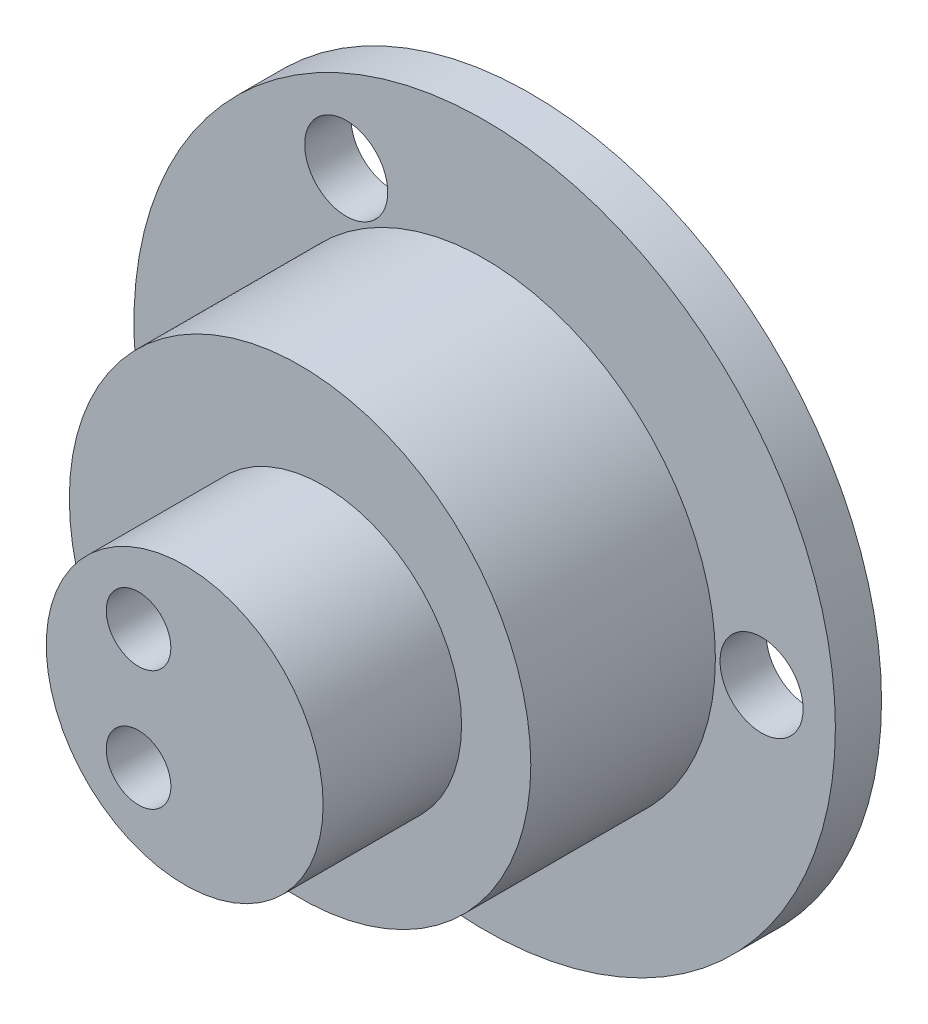
ISO-10303-21;
HEADER;
FILE_DESCRIPTION(('STEP AP214'),'2;1');
FILE_NAME('part.step','',(''),(''),'','','');
FILE_SCHEMA(('AUTOMOTIVE_DESIGN { 1 0 10303 214 1 1 1 1 }'));
ENDSEC;
DATA;
#1=APPLICATION_CONTEXT('core data for automotive mechanical design processes');
#2=APPLICATION_PROTOCOL_DEFINITION('international standard','automotive_design',2000,#1);
#3=PRODUCT_CONTEXT('',#1,'mechanical');
#4=PRODUCT('Part','Part','',(#3));
#5=PRODUCT_RELATED_PRODUCT_CATEGORY('part','',(#4));
#6=PRODUCT_DEFINITION_FORMATION('','',#4);
#7=PRODUCT_DEFINITION_CONTEXT('part definition',#1,'design');
#8=PRODUCT_DEFINITION('design','',#6,#7);
#9=PRODUCT_DEFINITION_SHAPE('','',#8);
#10=(LENGTH_UNIT() NAMED_UNIT(*) SI_UNIT(.MILLI.,.METRE.));
#11=(NAMED_UNIT(*) PLANE_ANGLE_UNIT() SI_UNIT($,.RADIAN.));
#12=(NAMED_UNIT(*) SI_UNIT($,.STERADIAN.) SOLID_ANGLE_UNIT());
#13=UNCERTAINTY_MEASURE_WITH_UNIT(LENGTH_MEASURE(1.E-05),#10,'distance_accuracy_value','');
#14=(GEOMETRIC_REPRESENTATION_CONTEXT(3) GLOBAL_UNCERTAINTY_ASSIGNED_CONTEXT((#13)) GLOBAL_UNIT_ASSIGNED_CONTEXT((#10,
#11,#12)) REPRESENTATION_CONTEXT('',''));
#15=CARTESIAN_POINT('',(0.,0.,0.));
#16=DIRECTION('',(0.,0.,1.));
#17=DIRECTION('',(1.,0.,0.));
#18=AXIS2_PLACEMENT_3D('',#15,#16,#17);
#19=CARTESIAN_POINT('',(0.,0.,1.));
#20=DIRECTION('',(0.,0.,1.));
#21=DIRECTION('',(1.,0.,0.));
#22=AXIS2_PLACEMENT_3D('',#19,#20,#21);
#23=PLANE('',#22);
#24=CARTESIAN_POINT('',(-3.00000000000002,-5.19615242270662,1.));
#25=DIRECTION('',(0.,0.,1.));
#26=DIRECTION('',(1.,0.,0.));
#27=AXIS2_PLACEMENT_3D('',#24,#25,#26);
#28=CIRCLE('',#27,0.9);
#29=CARTESIAN_POINT('',(-2.10000000000002,-5.19615242270662,1.));
#30=VERTEX_POINT('',#29);
#31=EDGE_CURVE('E82',#30,#30,#28,.T.);
#32=ORIENTED_EDGE('',*,*,#31,.F.);
#33=EDGE_LOOP('',(#32));
#34=FACE_BOUND('',#33,.T.);
#35=CARTESIAN_POINT('',(6.,0.,1.));
#36=DIRECTION('',(0.,0.,1.));
#37=DIRECTION('',(1.,0.,0.));
#38=AXIS2_PLACEMENT_3D('',#35,#36,#37);
#39=CIRCLE('',#38,0.899999999999999);
#40=CARTESIAN_POINT('',(6.9,0.,1.));
#41=VERTEX_POINT('',#40);
#42=EDGE_CURVE('E45',#41,#41,#39,.T.);
#43=ORIENTED_EDGE('',*,*,#42,.F.);
#44=EDGE_LOOP('',(#43));
#45=FACE_BOUND('',#44,.T.);
#46=CARTESIAN_POINT('',(-2.99999999999995,5.19615242270666,1.));
#47=DIRECTION('',(0.,0.,1.));
#48=DIRECTION('',(1.,0.,0.));
#49=AXIS2_PLACEMENT_3D('',#46,#47,#48);
#50=CIRCLE('',#49,0.9);
#51=CARTESIAN_POINT('',(-2.09999999999995,5.19615242270666,1.));
#52=VERTEX_POINT('',#51);
#53=EDGE_CURVE('E74',#52,#52,#50,.T.);
#54=ORIENTED_EDGE('',*,*,#53,.F.);
#55=EDGE_LOOP('',(#54));
#56=FACE_BOUND('',#55,.T.);
#57=CARTESIAN_POINT('',(0.,0.,1.));
#58=DIRECTION('',(0.,0.,1.));
#59=DIRECTION('',(1.,0.,0.));
#60=AXIS2_PLACEMENT_3D('',#57,#58,#59);
#61=CIRCLE('',#60,5.);
#62=CARTESIAN_POINT('',(5.,0.,1.));
#63=VERTEX_POINT('',#62);
#64=EDGE_CURVE('E61',#63,#63,#61,.T.);
#65=ORIENTED_EDGE('',*,*,#64,.F.);
#66=EDGE_LOOP('',(#65));
#67=FACE_BOUND('',#66,.T.);
#68=CARTESIAN_POINT('',(0.,0.,1.));
#69=DIRECTION('',(0.,0.,1.));
#70=DIRECTION('',(1.,0.,0.));
#71=AXIS2_PLACEMENT_3D('',#68,#69,#70);
#72=CIRCLE('',#71,7.6);
#73=CARTESIAN_POINT('',(7.6,0.,1.));
#74=VERTEX_POINT('',#73);
#75=EDGE_CURVE('E122',#74,#74,#72,.T.);
#76=ORIENTED_EDGE('',*,*,#75,.T.);
#77=EDGE_LOOP('',(#76));
#78=FACE_BOUND('',#77,.T.);
#79=ADVANCED_FACE('F36',(#34,#45,#56,#67,#78),#23,.T.);
#80=CARTESIAN_POINT('',(0.,0.,0.));
#81=DIRECTION('',(0.,0.,1.));
#82=DIRECTION('',(1.,0.,0.));
#83=AXIS2_PLACEMENT_3D('',#80,#81,#82);
#84=PLANE('',#83);
#85=CARTESIAN_POINT('',(0.,0.,0.));
#86=DIRECTION('',(0.,0.,1.));
#87=DIRECTION('',(1.,0.,0.));
#88=AXIS2_PLACEMENT_3D('',#85,#86,#87);
#89=CIRCLE('',#88,4.45);
#90=CARTESIAN_POINT('',(4.45,0.,0.));
#91=VERTEX_POINT('',#90);
#92=EDGE_CURVE('E66',#91,#91,#89,.T.);
#93=ORIENTED_EDGE('',*,*,#92,.T.);
#94=EDGE_LOOP('',(#93));
#95=FACE_BOUND('',#94,.T.);
#96=CARTESIAN_POINT('',(-2.99999999999995,5.19615242270666,0.));
#97=DIRECTION('',(0.,0.,1.));
#98=DIRECTION('',(1.,0.,0.));
#99=AXIS2_PLACEMENT_3D('',#96,#97,#98);
#100=CIRCLE('',#99,0.9);
#101=CARTESIAN_POINT('',(-2.09999999999995,5.19615242270666,0.));
#102=VERTEX_POINT('',#101);
#103=EDGE_CURVE('E73',#102,#102,#100,.T.);
#104=ORIENTED_EDGE('',*,*,#103,.T.);
#105=EDGE_LOOP('',(#104));
#106=FACE_BOUND('',#105,.T.);
#107=CARTESIAN_POINT('',(-3.00000000000002,-5.19615242270662,0.));
#108=DIRECTION('',(0.,0.,1.));
#109=DIRECTION('',(1.,0.,0.));
#110=AXIS2_PLACEMENT_3D('',#107,#108,#109);
#111=CIRCLE('',#110,0.9);
#112=CARTESIAN_POINT('',(-2.10000000000002,-5.19615242270662,0.));
#113=VERTEX_POINT('',#112);
#114=EDGE_CURVE('E78',#113,#113,#111,.T.);
#115=ORIENTED_EDGE('',*,*,#114,.T.);
#116=EDGE_LOOP('',(#115));
#117=FACE_BOUND('',#116,.T.);
#118=CARTESIAN_POINT('',(6.,0.,0.));
#119=DIRECTION('',(0.,0.,1.));
#120=DIRECTION('',(1.,0.,0.));
#121=AXIS2_PLACEMENT_3D('',#118,#119,#120);
#122=CIRCLE('',#121,0.899999999999999);
#123=CARTESIAN_POINT('',(6.9,0.,0.));
#124=VERTEX_POINT('',#123);
#125=EDGE_CURVE('E51',#124,#124,#122,.T.);
#126=ORIENTED_EDGE('',*,*,#125,.T.);
#127=EDGE_LOOP('',(#126));
#128=FACE_BOUND('',#127,.T.);
#129=CARTESIAN_POINT('',(0.,0.,0.));
#130=DIRECTION('',(0.,0.,1.));
#131=DIRECTION('',(1.,0.,0.));
#132=AXIS2_PLACEMENT_3D('',#129,#130,#131);
#133=CIRCLE('',#132,7.6);
#134=CARTESIAN_POINT('',(7.6,0.,0.));
#135=VERTEX_POINT('',#134);
#136=EDGE_CURVE('E40',#135,#135,#133,.T.);
#137=ORIENTED_EDGE('',*,*,#136,.F.);
#138=EDGE_LOOP('',(#137));
#139=FACE_BOUND('',#138,.T.);
#140=ADVANCED_FACE('F38',(#95,#106,#117,#128,#139),#84,.F.);
#141=CARTESIAN_POINT('',(6.,0.,1.));
#142=DIRECTION('',(0.,0.,-1.));
#143=DIRECTION('',(-1.,0.,0.));
#144=AXIS2_PLACEMENT_3D('',#141,#142,#143);
#145=CYLINDRICAL_SURFACE('',#144,0.899999999999999);
#146=ORIENTED_EDGE('',*,*,#42,.T.);
#147=EDGE_LOOP('',(#146));
#148=FACE_BOUND('',#147,.T.);
#149=ORIENTED_EDGE('',*,*,#125,.F.);
#150=EDGE_LOOP('',(#149));
#151=FACE_BOUND('',#150,.T.);
#152=ADVANCED_FACE('F94',(#148,#151),#145,.F.);
#153=CARTESIAN_POINT('',(-3.00000000000002,-5.19615242270662,1.));
#154=DIRECTION('',(0.,0.,-1.));
#155=DIRECTION('',(-1.,0.,0.));
#156=AXIS2_PLACEMENT_3D('',#153,#154,#155);
#157=CYLINDRICAL_SURFACE('',#156,0.9);
#158=ORIENTED_EDGE('',*,*,#31,.T.);
#159=EDGE_LOOP('',(#158));
#160=FACE_BOUND('',#159,.T.);
#161=ORIENTED_EDGE('',*,*,#114,.F.);
#162=EDGE_LOOP('',(#161));
#163=FACE_BOUND('',#162,.T.);
#164=ADVANCED_FACE('F96',(#160,#163),#157,.F.);
#165=CARTESIAN_POINT('',(-2.99999999999995,5.19615242270666,1.));
#166=DIRECTION('',(0.,0.,-1.));
#167=DIRECTION('',(-1.,0.,0.));
#168=AXIS2_PLACEMENT_3D('',#165,#166,#167);
#169=CYLINDRICAL_SURFACE('',#168,0.9);
#170=ORIENTED_EDGE('',*,*,#53,.T.);
#171=EDGE_LOOP('',(#170));
#172=FACE_BOUND('',#171,.T.);
#173=ORIENTED_EDGE('',*,*,#103,.F.);
#174=EDGE_LOOP('',(#173));
#175=FACE_BOUND('',#174,.T.);
#176=ADVANCED_FACE('F102',(#172,#175),#169,.F.);
#177=CARTESIAN_POINT('',(0.,0.,1.));
#178=DIRECTION('',(0.,0.,-1.));
#179=DIRECTION('',(-1.,0.,0.));
#180=AXIS2_PLACEMENT_3D('',#177,#178,#179);
#181=CYLINDRICAL_SURFACE('',#180,4.45);
#182=CARTESIAN_POINT('',(0.,0.,2.));
#183=DIRECTION('',(0.,0.,-1.));
#184=DIRECTION('',(-1.,0.,0.));
#185=AXIS2_PLACEMENT_3D('',#182,#183,#184);
#186=CIRCLE('',#185,4.45);
#187=CARTESIAN_POINT('',(-4.45,0.,2.));
#188=VERTEX_POINT('',#187);
#189=EDGE_CURVE('E57',#188,#188,#186,.T.);
#190=ORIENTED_EDGE('',*,*,#189,.F.);
#191=EDGE_LOOP('',(#190));
#192=FACE_BOUND('',#191,.T.);
#193=ORIENTED_EDGE('',*,*,#92,.F.);
#194=EDGE_LOOP('',(#193));
#195=FACE_BOUND('',#194,.T.);
#196=ADVANCED_FACE('F175',(#192,#195),#181,.F.);
#197=CARTESIAN_POINT('',(0.,0.,5.));
#198=DIRECTION('',(0.,0.,-1.));
#199=DIRECTION('',(-1.,0.,0.));
#200=AXIS2_PLACEMENT_3D('',#197,#198,#199);
#201=CYLINDRICAL_SURFACE('',#200,5.);
#202=CARTESIAN_POINT('',(0.,0.,5.));
#203=DIRECTION('',(0.,0.,1.));
#204=DIRECTION('',(1.,0.,0.));
#205=AXIS2_PLACEMENT_3D('',#202,#203,#204);
#206=CIRCLE('',#205,5.);
#207=CARTESIAN_POINT('',(5.,0.,5.));
#208=VERTEX_POINT('',#207);
#209=EDGE_CURVE('E62',#208,#208,#206,.T.);
#210=ORIENTED_EDGE('',*,*,#209,.F.);
#211=EDGE_LOOP('',(#210));
#212=FACE_BOUND('',#211,.T.);
#213=ORIENTED_EDGE('',*,*,#64,.T.);
#214=EDGE_LOOP('',(#213));
#215=FACE_BOUND('',#214,.T.);
#216=ADVANCED_FACE('F171',(#212,#215),#201,.T.);
#217=CARTESIAN_POINT('',(0.,0.,5.));
#218=DIRECTION('',(0.,0.,1.));
#219=DIRECTION('',(1.,0.,0.));
#220=AXIS2_PLACEMENT_3D('',#217,#218,#219);
#221=PLANE('',#220);
#222=CARTESIAN_POINT('',(0.5,0.,5.));
#223=DIRECTION('',(0.,0.,1.));
#224=DIRECTION('',(1.,0.,0.));
#225=AXIS2_PLACEMENT_3D('',#222,#223,#224);
#226=CIRCLE('',#225,3.);
#227=CARTESIAN_POINT('',(3.5,0.,5.));
#228=VERTEX_POINT('',#227);
#229=EDGE_CURVE('E10',#228,#228,#226,.T.);
#230=ORIENTED_EDGE('',*,*,#229,.F.);
#231=EDGE_LOOP('',(#230));
#232=FACE_BOUND('',#231,.T.);
#233=ORIENTED_EDGE('',*,*,#209,.T.);
#234=EDGE_LOOP('',(#233));
#235=FACE_BOUND('',#234,.T.);
#236=ADVANCED_FACE('F164',(#232,#235),#221,.T.);
#237=CARTESIAN_POINT('',(0.,0.,2.));
#238=DIRECTION('',(0.,0.,-1.));
#239=DIRECTION('',(-1.,0.,0.));
#240=AXIS2_PLACEMENT_3D('',#237,#238,#239);
#241=PLANE('',#240);
#242=CARTESIAN_POINT('',(-0.50000000000003,1.3,2.));
#243=DIRECTION('',(0.,0.,-1.));
#244=DIRECTION('',(-1.,0.,0.));
#245=AXIS2_PLACEMENT_3D('',#242,#243,#244);
#246=CIRCLE('',#245,0.7);
#247=CARTESIAN_POINT('',(-1.20000000000003,1.3,2.));
#248=VERTEX_POINT('',#247);
#249=EDGE_CURVE('E140',#248,#248,#246,.T.);
#250=ORIENTED_EDGE('',*,*,#249,.F.);
#251=EDGE_LOOP('',(#250));
#252=FACE_BOUND('',#251,.T.);
#253=CARTESIAN_POINT('',(-0.50000000000002,-1.3,2.));
#254=DIRECTION('',(0.,0.,-1.));
#255=DIRECTION('',(-1.,0.,0.));
#256=AXIS2_PLACEMENT_3D('',#253,#254,#255);
#257=CIRCLE('',#256,0.7);
#258=CARTESIAN_POINT('',(-1.20000000000002,-1.3,2.));
#259=VERTEX_POINT('',#258);
#260=EDGE_CURVE('E134',#259,#259,#257,.T.);
#261=ORIENTED_EDGE('',*,*,#260,.F.);
#262=EDGE_LOOP('',(#261));
#263=FACE_BOUND('',#262,.T.);
#264=ORIENTED_EDGE('',*,*,#189,.T.);
#265=EDGE_LOOP('',(#264));
#266=FACE_BOUND('',#265,.T.);
#267=ADVANCED_FACE('F153',(#252,#263,#266),#241,.T.);
#268=CARTESIAN_POINT('',(0.5,0.,8.));
#269=DIRECTION('',(0.,0.,-1.));
#270=DIRECTION('',(-1.,0.,0.));
#271=AXIS2_PLACEMENT_3D('',#268,#269,#270);
#272=CYLINDRICAL_SURFACE('',#271,3.);
#273=CARTESIAN_POINT('',(0.5,0.,8.));
#274=DIRECTION('',(0.,0.,1.));
#275=DIRECTION('',(1.,0.,0.));
#276=AXIS2_PLACEMENT_3D('',#273,#274,#275);
#277=CIRCLE('',#276,3.);
#278=CARTESIAN_POINT('',(3.5,0.,8.));
#279=VERTEX_POINT('',#278);
#280=EDGE_CURVE('E55',#279,#279,#277,.T.);
#281=ORIENTED_EDGE('',*,*,#280,.F.);
#282=EDGE_LOOP('',(#281));
#283=FACE_BOUND('',#282,.T.);
#284=ORIENTED_EDGE('',*,*,#229,.T.);
#285=EDGE_LOOP('',(#284));
#286=FACE_BOUND('',#285,.T.);
#287=ADVANCED_FACE('F151',(#283,#286),#272,.T.);
#288=CARTESIAN_POINT('',(0.5,0.,8.));
#289=DIRECTION('',(0.,0.,1.));
#290=DIRECTION('',(1.,0.,0.));
#291=AXIS2_PLACEMENT_3D('',#288,#289,#290);
#292=PLANE('',#291);
#293=CARTESIAN_POINT('',(-0.50000000000003,1.3,8.));
#294=DIRECTION('',(0.,0.,1.));
#295=DIRECTION('',(1.,0.,0.));
#296=AXIS2_PLACEMENT_3D('',#293,#294,#295);
#297=CIRCLE('',#296,0.7);
#298=CARTESIAN_POINT('',(0.19999999999997,1.3,8.));
#299=VERTEX_POINT('',#298);
#300=EDGE_CURVE('E130',#299,#299,#297,.T.);
#301=ORIENTED_EDGE('',*,*,#300,.F.);
#302=EDGE_LOOP('',(#301));
#303=FACE_BOUND('',#302,.T.);
#304=CARTESIAN_POINT('',(-0.50000000000002,-1.3,8.));
#305=DIRECTION('',(0.,0.,1.));
#306=DIRECTION('',(-1.,0.,0.));
#307=AXIS2_PLACEMENT_3D('',#304,#305,#306);
#308=CIRCLE('',#307,0.7);
#309=CARTESIAN_POINT('',(-1.20000000000002,-1.3,8.));
#310=VERTEX_POINT('',#309);
#311=EDGE_CURVE('E128',#310,#310,#308,.T.);
#312=ORIENTED_EDGE('',*,*,#311,.F.);
#313=EDGE_LOOP('',(#312));
#314=FACE_BOUND('',#313,.T.);
#315=ORIENTED_EDGE('',*,*,#280,.T.);
#316=EDGE_LOOP('',(#315));
#317=FACE_BOUND('',#316,.T.);
#318=ADVANCED_FACE('F149',(#303,#314,#317),#292,.T.);
#319=CARTESIAN_POINT('',(-0.50000000000002,-1.3,-2.));
#320=DIRECTION('',(0.,0.,1.));
#321=DIRECTION('',(1.,0.,0.));
#322=AXIS2_PLACEMENT_3D('',#319,#320,#321);
#323=CYLINDRICAL_SURFACE('',#322,0.7);
#324=ORIENTED_EDGE('',*,*,#260,.T.);
#325=EDGE_LOOP('',(#324));
#326=FACE_BOUND('',#325,.T.);
#327=ORIENTED_EDGE('',*,*,#311,.T.);
#328=EDGE_LOOP('',(#327));
#329=FACE_BOUND('',#328,.T.);
#330=ADVANCED_FACE('F160',(#326,#329),#323,.F.);
#331=CARTESIAN_POINT('',(-0.50000000000003,1.3,-2.));
#332=DIRECTION('',(0.,0.,1.));
#333=DIRECTION('',(1.,0.,0.));
#334=AXIS2_PLACEMENT_3D('',#331,#332,#333);
#335=CYLINDRICAL_SURFACE('',#334,0.7);
#336=ORIENTED_EDGE('',*,*,#249,.T.);
#337=EDGE_LOOP('',(#336));
#338=FACE_BOUND('',#337,.T.);
#339=ORIENTED_EDGE('',*,*,#300,.T.);
#340=EDGE_LOOP('',(#339));
#341=FACE_BOUND('',#340,.T.);
#342=ADVANCED_FACE('F219',(#338,#341),#335,.F.);
#343=CARTESIAN_POINT('',(0.,0.,-9.));
#344=DIRECTION('',(0.,0.,1.));
#345=DIRECTION('',(1.,0.,0.));
#346=AXIS2_PLACEMENT_3D('',#343,#344,#345);
#347=CYLINDRICAL_SURFACE('',#346,7.6);
#348=ORIENTED_EDGE('',*,*,#75,.F.);
#349=EDGE_LOOP('',(#348));
#350=FACE_BOUND('',#349,.T.);
#351=ORIENTED_EDGE('',*,*,#136,.T.);
#352=EDGE_LOOP('',(#351));
#353=FACE_BOUND('',#352,.T.);
#354=ADVANCED_FACE('F227',(#350,#353),#347,.T.);
#355=CLOSED_SHELL('',(#79,#140,#152,#164,#176,#196,#216,#236,#267,#287,#318,#330,#342,#354));
#356=MANIFOLD_SOLID_BREP('B2',#355);
#357=ADVANCED_BREP_SHAPE_REPRESENTATION('',(#18,#356),#14);
#358=SHAPE_DEFINITION_REPRESENTATION(#9,#357);
ENDSEC;
END-ISO-10303-21;
